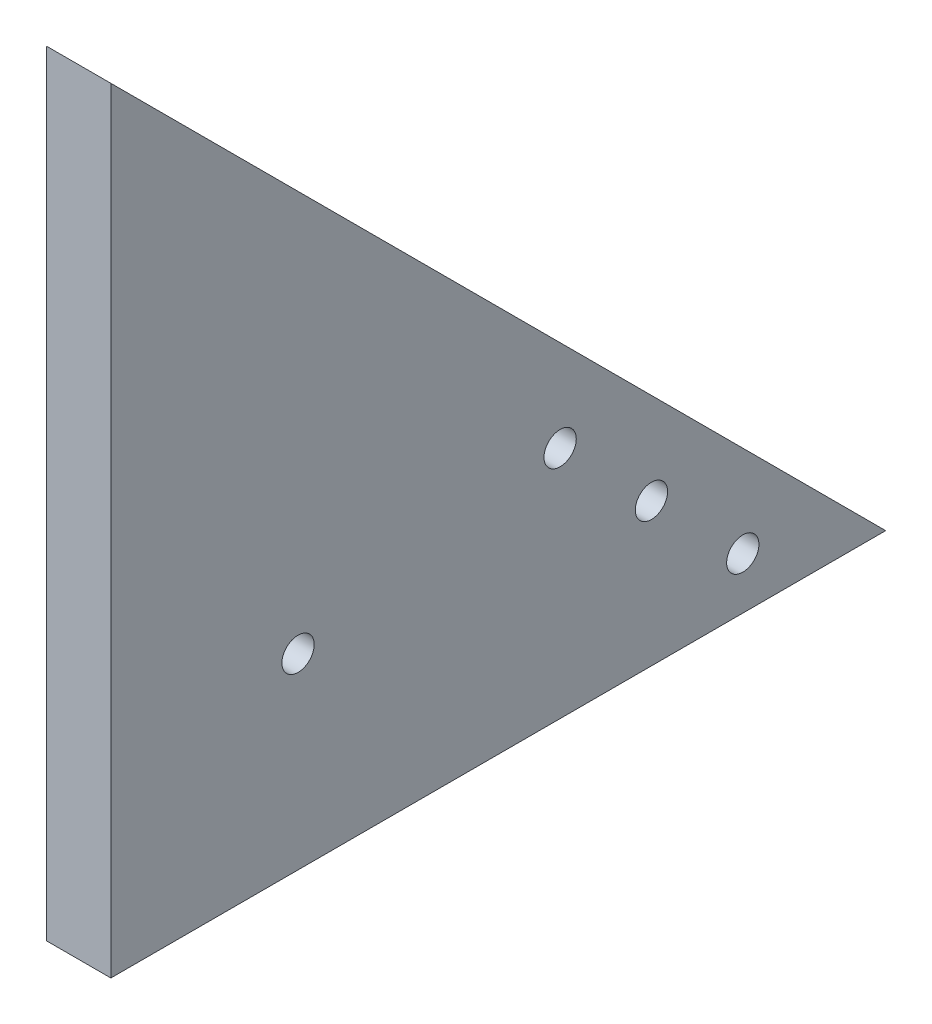
ISO-10303-21;
HEADER;
FILE_DESCRIPTION(('STEP AP214'),'2;1');
FILE_NAME('part.step','',(''),(''),'','','');
FILE_SCHEMA(('AUTOMOTIVE_DESIGN { 1 0 10303 214 1 1 1 1 }'));
ENDSEC;
DATA;
#1=APPLICATION_CONTEXT('core data for automotive mechanical design processes');
#2=APPLICATION_PROTOCOL_DEFINITION('international standard','automotive_design',2000,#1);
#3=PRODUCT_CONTEXT('',#1,'mechanical');
#4=PRODUCT('Part','Part','',(#3));
#5=PRODUCT_RELATED_PRODUCT_CATEGORY('part','',(#4));
#6=PRODUCT_DEFINITION_FORMATION('','',#4);
#7=PRODUCT_DEFINITION_CONTEXT('part definition',#1,'design');
#8=PRODUCT_DEFINITION('design','',#6,#7);
#9=PRODUCT_DEFINITION_SHAPE('','',#8);
#10=(LENGTH_UNIT() NAMED_UNIT(*) SI_UNIT(.MILLI.,.METRE.));
#11=(NAMED_UNIT(*) PLANE_ANGLE_UNIT() SI_UNIT($,.RADIAN.));
#12=(NAMED_UNIT(*) SI_UNIT($,.STERADIAN.) SOLID_ANGLE_UNIT());
#13=UNCERTAINTY_MEASURE_WITH_UNIT(LENGTH_MEASURE(1.E-05),#10,'distance_accuracy_value','');
#14=(GEOMETRIC_REPRESENTATION_CONTEXT(3) GLOBAL_UNCERTAINTY_ASSIGNED_CONTEXT((#13)) GLOBAL_UNIT_ASSIGNED_CONTEXT((#10,
#11,#12)) REPRESENTATION_CONTEXT('',''));
#15=CARTESIAN_POINT('',(0.,0.,0.));
#16=DIRECTION('',(0.,0.,1.));
#17=DIRECTION('',(1.,0.,0.));
#18=AXIS2_PLACEMENT_3D('',#15,#16,#17);
#19=CARTESIAN_POINT('',(10.,0.,0.));
#20=DIRECTION('',(0.,1.,0.));
#21=DIRECTION('',(0.,0.,1.));
#22=AXIS2_PLACEMENT_3D('',#19,#20,#21);
#23=PLANE('',#22);
#24=DIRECTION('',(0.,0.,-1.));
#25=VECTOR('',#24,1.);
#26=CARTESIAN_POINT('',(0.,0.,0.));
#27=LINE('',#26,#25);
#28=CARTESIAN_POINT('',(0.,0.,0.));
#29=VERTEX_POINT('',#28);
#30=CARTESIAN_POINT('',(0.,0.,-120.));
#31=VERTEX_POINT('',#30);
#32=EDGE_CURVE('E84',#29,#31,#27,.T.);
#33=ORIENTED_EDGE('',*,*,#32,.T.);
#34=DIRECTION('',(-1.,0.,0.));
#35=VECTOR('',#34,1.);
#36=CARTESIAN_POINT('',(10.,0.,-120.));
#37=LINE('',#36,#35);
#38=CARTESIAN_POINT('',(10.,0.,-120.));
#39=VERTEX_POINT('',#38);
#40=EDGE_CURVE('E11',#39,#31,#37,.T.);
#41=ORIENTED_EDGE('',*,*,#40,.F.);
#42=DIRECTION('',(0.,0.,-1.));
#43=VECTOR('',#42,1.);
#44=CARTESIAN_POINT('',(10.,0.,0.));
#45=LINE('',#44,#43);
#46=CARTESIAN_POINT('',(10.,0.,0.));
#47=VERTEX_POINT('',#46);
#48=EDGE_CURVE('E77',#47,#39,#45,.T.);
#49=ORIENTED_EDGE('',*,*,#48,.F.);
#50=DIRECTION('',(-1.,0.,0.));
#51=VECTOR('',#50,1.);
#52=CARTESIAN_POINT('',(10.,0.,0.));
#53=LINE('',#52,#51);
#54=EDGE_CURVE('E85',#47,#29,#53,.T.);
#55=ORIENTED_EDGE('',*,*,#54,.T.);
#56=EDGE_LOOP('',(#33,#41,#49,#55));
#57=FACE_BOUND('',#56,.T.);
#58=ADVANCED_FACE('F37',(#57),#23,.F.);
#59=CARTESIAN_POINT('',(10.,0.,-120.));
#60=DIRECTION('',(0.,-0.707106781186548,0.707106781186548));
#61=DIRECTION('',(0.,-0.707106781186548,-0.707106781186548));
#62=AXIS2_PLACEMENT_3D('',#59,#60,#61);
#63=PLANE('',#62);
#64=DIRECTION('',(0.,0.707106781186547,0.707106781186547));
#65=VECTOR('',#64,1.);
#66=CARTESIAN_POINT('',(0.,0.,-120.));
#67=LINE('',#66,#65);
#68=CARTESIAN_POINT('',(0.,120.,0.));
#69=VERTEX_POINT('',#68);
#70=EDGE_CURVE('E65',#31,#69,#67,.T.);
#71=ORIENTED_EDGE('',*,*,#70,.T.);
#72=DIRECTION('',(-1.,0.,0.));
#73=VECTOR('',#72,1.);
#74=CARTESIAN_POINT('',(10.,120.,0.));
#75=LINE('',#74,#73);
#76=CARTESIAN_POINT('',(10.,120.,0.));
#77=VERTEX_POINT('',#76);
#78=EDGE_CURVE('E45',#77,#69,#75,.T.);
#79=ORIENTED_EDGE('',*,*,#78,.F.);
#80=DIRECTION('',(0.,0.707106781186547,0.707106781186547));
#81=VECTOR('',#80,1.);
#82=CARTESIAN_POINT('',(10.,0.,-120.));
#83=LINE('',#82,#81);
#84=EDGE_CURVE('E73',#39,#77,#83,.T.);
#85=ORIENTED_EDGE('',*,*,#84,.F.);
#86=ORIENTED_EDGE('',*,*,#40,.T.);
#87=EDGE_LOOP('',(#71,#79,#85,#86));
#88=FACE_BOUND('',#87,.T.);
#89=ADVANCED_FACE('F74',(#88),#63,.F.);
#90=CARTESIAN_POINT('',(10.,0.,0.));
#91=DIRECTION('',(0.,0.,-1.));
#92=DIRECTION('',(-1.,0.,0.));
#93=AXIS2_PLACEMENT_3D('',#90,#91,#92);
#94=PLANE('',#93);
#95=DIRECTION('',(0.,-1.,0.));
#96=VECTOR('',#95,1.);
#97=CARTESIAN_POINT('',(0.,0.,0.));
#98=LINE('',#97,#96);
#99=EDGE_CURVE('E70',#69,#29,#98,.T.);
#100=ORIENTED_EDGE('',*,*,#99,.T.);
#101=ORIENTED_EDGE('',*,*,#54,.F.);
#102=DIRECTION('',(0.,-1.,0.));
#103=VECTOR('',#102,1.);
#104=CARTESIAN_POINT('',(10.,0.,0.));
#105=LINE('',#104,#103);
#106=EDGE_CURVE('E53',#77,#47,#105,.T.);
#107=ORIENTED_EDGE('',*,*,#106,.F.);
#108=ORIENTED_EDGE('',*,*,#78,.T.);
#109=EDGE_LOOP('',(#100,#101,#107,#108));
#110=FACE_BOUND('',#109,.T.);
#111=ADVANCED_FACE('F96',(#110),#94,.F.);
#112=CARTESIAN_POINT('',(10.,0.,0.));
#113=DIRECTION('',(1.,0.,0.));
#114=DIRECTION('',(0.,0.,-1.));
#115=AXIS2_PLACEMENT_3D('',#112,#113,#114);
#116=PLANE('',#115);
#117=CARTESIAN_POINT('',(10.,28.9913780286484,-28.9913780286484));
#118=DIRECTION('',(1.,0.,0.));
#119=DIRECTION('',(0.,0.,-1.));
#120=AXIS2_PLACEMENT_3D('',#117,#118,#119);
#121=CIRCLE('',#120,2.5);
#122=CARTESIAN_POINT('',(10.,28.9913780286484,-31.4913780286484));
#123=VERTEX_POINT('',#122);
#124=EDGE_CURVE('E175',#123,#123,#121,.T.);
#125=ORIENTED_EDGE('',*,*,#124,.F.);
#126=EDGE_LOOP('',(#125));
#127=FACE_BOUND('',#126,.T.);
#128=CARTESIAN_POINT('',(10.,36.2793714257353,-69.5784929505338));
#129=DIRECTION('',(1.,0.,0.));
#130=DIRECTION('',(0.,0.,-1.));
#131=AXIS2_PLACEMENT_3D('',#128,#129,#130);
#132=CIRCLE('',#131,2.50000000000001);
#133=CARTESIAN_POINT('',(10.,36.2793714257353,-72.0784929505338));
#134=VERTEX_POINT('',#133);
#135=EDGE_CURVE('E177',#134,#134,#132,.T.);
#136=ORIENTED_EDGE('',*,*,#135,.F.);
#137=EDGE_LOOP('',(#136));
#138=FACE_BOUND('',#137,.T.);
#139=CARTESIAN_POINT('',(10.,7.99510017827339,-97.8627641979956));
#140=DIRECTION('',(1.,0.,0.));
#141=DIRECTION('',(0.,0.,-1.));
#142=AXIS2_PLACEMENT_3D('',#139,#140,#141);
#143=CIRCLE('',#142,2.5);
#144=CARTESIAN_POINT('',(10.,7.99510017827339,-100.362764197996));
#145=VERTEX_POINT('',#144);
#146=EDGE_CURVE('E186',#145,#145,#143,.T.);
#147=ORIENTED_EDGE('',*,*,#146,.F.);
#148=EDGE_LOOP('',(#147));
#149=FACE_BOUND('',#148,.T.);
#150=CARTESIAN_POINT('',(10.,22.1372358020043,-83.7206285742647));
#151=DIRECTION('',(1.,0.,0.));
#152=DIRECTION('',(0.,0.,-1.));
#153=AXIS2_PLACEMENT_3D('',#150,#151,#152);
#154=CIRCLE('',#153,2.5);
#155=CARTESIAN_POINT('',(10.,22.1372358020043,-86.2206285742647));
#156=VERTEX_POINT('',#155);
#157=EDGE_CURVE('E91',#156,#156,#154,.T.);
#158=ORIENTED_EDGE('',*,*,#157,.F.);
#159=EDGE_LOOP('',(#158));
#160=FACE_BOUND('',#159,.T.);
#161=ORIENTED_EDGE('',*,*,#48,.T.);
#162=ORIENTED_EDGE('',*,*,#84,.T.);
#163=ORIENTED_EDGE('',*,*,#106,.T.);
#164=EDGE_LOOP('',(#161,#162,#163));
#165=FACE_BOUND('',#164,.T.);
#166=ADVANCED_FACE('F80',(#127,#138,#149,#160,#165),#116,.T.);
#167=CARTESIAN_POINT('',(0.,0.,0.));
#168=DIRECTION('',(1.,0.,0.));
#169=DIRECTION('',(0.,0.,-1.));
#170=AXIS2_PLACEMENT_3D('',#167,#168,#169);
#171=PLANE('',#170);
#172=CARTESIAN_POINT('',(0.,28.9913780286484,-28.9913780286484));
#173=DIRECTION('',(1.,0.,0.));
#174=DIRECTION('',(0.,0.,-1.));
#175=AXIS2_PLACEMENT_3D('',#172,#173,#174);
#176=CIRCLE('',#175,2.5);
#177=CARTESIAN_POINT('',(0.,28.9913780286484,-31.4913780286484));
#178=VERTEX_POINT('',#177);
#179=EDGE_CURVE('E172',#178,#178,#176,.T.);
#180=ORIENTED_EDGE('',*,*,#179,.T.);
#181=EDGE_LOOP('',(#180));
#182=FACE_BOUND('',#181,.T.);
#183=CARTESIAN_POINT('',(0.,36.2793714257353,-69.5784929505338));
#184=DIRECTION('',(1.,0.,0.));
#185=DIRECTION('',(0.,0.,-1.));
#186=AXIS2_PLACEMENT_3D('',#183,#184,#185);
#187=CIRCLE('',#186,2.50000000000001);
#188=CARTESIAN_POINT('',(0.,36.2793714257353,-72.0784929505338));
#189=VERTEX_POINT('',#188);
#190=EDGE_CURVE('E191',#189,#189,#187,.T.);
#191=ORIENTED_EDGE('',*,*,#190,.T.);
#192=EDGE_LOOP('',(#191));
#193=FACE_BOUND('',#192,.T.);
#194=CARTESIAN_POINT('',(0.,7.99510017827339,-97.8627641979956));
#195=DIRECTION('',(1.,0.,0.));
#196=DIRECTION('',(0.,0.,-1.));
#197=AXIS2_PLACEMENT_3D('',#194,#195,#196);
#198=CIRCLE('',#197,2.5);
#199=CARTESIAN_POINT('',(0.,7.99510017827339,-100.362764197996));
#200=VERTEX_POINT('',#199);
#201=EDGE_CURVE('E182',#200,#200,#198,.T.);
#202=ORIENTED_EDGE('',*,*,#201,.T.);
#203=EDGE_LOOP('',(#202));
#204=FACE_BOUND('',#203,.T.);
#205=CARTESIAN_POINT('',(0.,22.1372358020043,-83.7206285742647));
#206=DIRECTION('',(1.,0.,0.));
#207=DIRECTION('',(0.,0.,-1.));
#208=AXIS2_PLACEMENT_3D('',#205,#206,#207);
#209=CIRCLE('',#208,2.5);
#210=CARTESIAN_POINT('',(0.,22.1372358020043,-86.2206285742647));
#211=VERTEX_POINT('',#210);
#212=EDGE_CURVE('E87',#211,#211,#209,.T.);
#213=ORIENTED_EDGE('',*,*,#212,.T.);
#214=EDGE_LOOP('',(#213));
#215=FACE_BOUND('',#214,.T.);
#216=ORIENTED_EDGE('',*,*,#32,.F.);
#217=ORIENTED_EDGE('',*,*,#99,.F.);
#218=ORIENTED_EDGE('',*,*,#70,.F.);
#219=EDGE_LOOP('',(#216,#217,#218));
#220=FACE_BOUND('',#219,.T.);
#221=ADVANCED_FACE('F97',(#182,#193,#204,#215,#220),#171,.F.);
#222=CARTESIAN_POINT('',(0.,22.1372358020043,-83.7206285742647));
#223=DIRECTION('',(1.,0.,0.));
#224=DIRECTION('',(0.,0.,-1.));
#225=AXIS2_PLACEMENT_3D('',#222,#223,#224);
#226=CYLINDRICAL_SURFACE('',#225,2.5);
#227=ORIENTED_EDGE('',*,*,#212,.F.);
#228=EDGE_LOOP('',(#227));
#229=FACE_BOUND('',#228,.T.);
#230=ORIENTED_EDGE('',*,*,#157,.T.);
#231=EDGE_LOOP('',(#230));
#232=FACE_BOUND('',#231,.T.);
#233=ADVANCED_FACE('F99',(#229,#232),#226,.F.);
#234=CARTESIAN_POINT('',(0.,7.99510017827339,-97.8627641979956));
#235=DIRECTION('',(1.,0.,0.));
#236=DIRECTION('',(0.,0.,-1.));
#237=AXIS2_PLACEMENT_3D('',#234,#235,#236);
#238=CYLINDRICAL_SURFACE('',#237,2.5);
#239=ORIENTED_EDGE('',*,*,#201,.F.);
#240=EDGE_LOOP('',(#239));
#241=FACE_BOUND('',#240,.T.);
#242=ORIENTED_EDGE('',*,*,#146,.T.);
#243=EDGE_LOOP('',(#242));
#244=FACE_BOUND('',#243,.T.);
#245=ADVANCED_FACE('F106',(#241,#244),#238,.F.);
#246=CARTESIAN_POINT('',(0.,36.2793714257353,-69.5784929505338));
#247=DIRECTION('',(1.,0.,0.));
#248=DIRECTION('',(0.,0.,-1.));
#249=AXIS2_PLACEMENT_3D('',#246,#247,#248);
#250=CYLINDRICAL_SURFACE('',#249,2.50000000000001);
#251=ORIENTED_EDGE('',*,*,#190,.F.);
#252=EDGE_LOOP('',(#251));
#253=FACE_BOUND('',#252,.T.);
#254=ORIENTED_EDGE('',*,*,#135,.T.);
#255=EDGE_LOOP('',(#254));
#256=FACE_BOUND('',#255,.T.);
#257=ADVANCED_FACE('F146',(#253,#256),#250,.F.);
#258=CARTESIAN_POINT('',(0.,28.9913780286484,-28.9913780286484));
#259=DIRECTION('',(1.,0.,0.));
#260=DIRECTION('',(0.,0.,-1.));
#261=AXIS2_PLACEMENT_3D('',#258,#259,#260);
#262=CYLINDRICAL_SURFACE('',#261,2.5);
#263=ORIENTED_EDGE('',*,*,#179,.F.);
#264=EDGE_LOOP('',(#263));
#265=FACE_BOUND('',#264,.T.);
#266=ORIENTED_EDGE('',*,*,#124,.T.);
#267=EDGE_LOOP('',(#266));
#268=FACE_BOUND('',#267,.T.);
#269=ADVANCED_FACE('F156',(#265,#268),#262,.F.);
#270=CLOSED_SHELL('',(#58,#89,#111,#166,#221,#233,#245,#257,#269));
#271=MANIFOLD_SOLID_BREP('B2',#270);
#272=ADVANCED_BREP_SHAPE_REPRESENTATION('',(#18,#271),#14);
#273=SHAPE_DEFINITION_REPRESENTATION(#9,#272);
ENDSEC;
END-ISO-10303-21;
